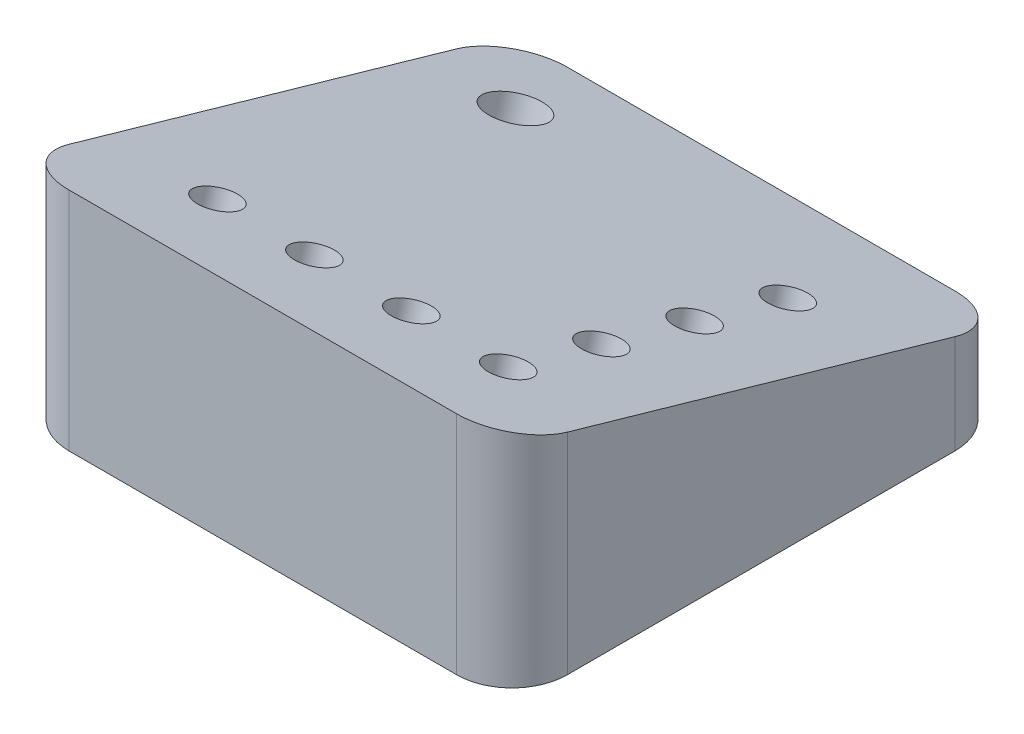
ISO-10303-21;
HEADER;
FILE_DESCRIPTION(('STEP AP214'),'2;1');
FILE_NAME('part.step','',(''),(''),'','','');
FILE_SCHEMA(('AUTOMOTIVE_DESIGN { 1 0 10303 214 1 1 1 1 }'));
ENDSEC;
DATA;
#1=APPLICATION_CONTEXT('core data for automotive mechanical design processes');
#2=APPLICATION_PROTOCOL_DEFINITION('international standard','automotive_design',2000,#1);
#3=PRODUCT_CONTEXT('',#1,'mechanical');
#4=PRODUCT('Part','Part','',(#3));
#5=PRODUCT_RELATED_PRODUCT_CATEGORY('part','',(#4));
#6=PRODUCT_DEFINITION_FORMATION('','',#4);
#7=PRODUCT_DEFINITION_CONTEXT('part definition',#1,'design');
#8=PRODUCT_DEFINITION('design','',#6,#7);
#9=PRODUCT_DEFINITION_SHAPE('','',#8);
#10=(LENGTH_UNIT() NAMED_UNIT(*) SI_UNIT(.MILLI.,.METRE.));
#11=(NAMED_UNIT(*) PLANE_ANGLE_UNIT() SI_UNIT($,.RADIAN.));
#12=(NAMED_UNIT(*) SI_UNIT($,.STERADIAN.) SOLID_ANGLE_UNIT());
#13=UNCERTAINTY_MEASURE_WITH_UNIT(LENGTH_MEASURE(1.E-05),#10,'distance_accuracy_value','');
#14=(GEOMETRIC_REPRESENTATION_CONTEXT(3) GLOBAL_UNCERTAINTY_ASSIGNED_CONTEXT((#13)) GLOBAL_UNIT_ASSIGNED_CONTEXT((#10,
#11,#12)) REPRESENTATION_CONTEXT('',''));
#15=CARTESIAN_POINT('',(0.,0.,0.));
#16=DIRECTION('',(0.,0.,1.));
#17=DIRECTION('',(1.,0.,0.));
#18=AXIS2_PLACEMENT_3D('',#15,#16,#17);
#19=CARTESIAN_POINT('',(36.,12.,-37.2354791231056));
#20=DIRECTION('',(0.,-0.961261695938321,0.275637355816993));
#21=DIRECTION('',(0.,-0.275637355816993,-0.961261695938321));
#22=AXIS2_PLACEMENT_3D('',#19,#20,#21);
#23=PLANE('',#22);
#24=CARTESIAN_POINT('',(22.,17.2099758488821,-19.0661340956516));
#25=DIRECTION('',(0.,0.961261695938321,-0.275637355816993));
#26=DIRECTION('',(0.,0.275637355816993,0.961261695938321));
#27=AXIS2_PLACEMENT_3D('',#24,#25,#26);
#28=CIRCLE('',#27,3.);
#29=CARTESIAN_POINT('',(22.,18.036887916333,-16.1823490078366));
#30=VERTEX_POINT('',#29);
#31=EDGE_CURVE('E262',#30,#30,#28,.T.);
#32=ORIENTED_EDGE('',*,*,#31,.F.);
#33=EDGE_LOOP('',(#32));
#34=FACE_BOUND('',#33,.T.);
#35=CARTESIAN_POINT('',(22.,21.06889883032,-5.60847035251506));
#36=DIRECTION('',(0.,0.961261695938321,-0.275637355816993));
#37=DIRECTION('',(0.,0.275637355816993,0.961261695938321));
#38=AXIS2_PLACEMENT_3D('',#35,#36,#37);
#39=CIRCLE('',#38,3.);
#40=CARTESIAN_POINT('',(22.,21.8958108977709,-2.7246852647001));
#41=VERTEX_POINT('',#40);
#42=EDGE_CURVE('E256',#41,#41,#39,.T.);
#43=ORIENTED_EDGE('',*,*,#42,.F.);
#44=EDGE_LOOP('',(#43));
#45=FACE_BOUND('',#44,.T.);
#46=CARTESIAN_POINT('',(22.,24.9278218117579,7.84919339062143));
#47=DIRECTION('',(0.,0.961261695938321,-0.275637355816993));
#48=DIRECTION('',(0.,0.275637355816993,0.961261695938321));
#49=AXIS2_PLACEMENT_3D('',#46,#47,#48);
#50=CIRCLE('',#49,3.);
#51=CARTESIAN_POINT('',(22.,25.7547338792088,10.7329784784364));
#52=VERTEX_POINT('',#51);
#53=EDGE_CURVE('E250',#52,#52,#50,.T.);
#54=ORIENTED_EDGE('',*,*,#53,.F.);
#55=EDGE_LOOP('',(#54));
#56=FACE_BOUND('',#55,.T.);
#57=CARTESIAN_POINT('',(22.,28.7867447931957,21.3068571337579));
#58=DIRECTION('',(0.,0.961261695938321,-0.275637355816993));
#59=DIRECTION('',(0.,0.275637355816993,0.961261695938321));
#60=AXIS2_PLACEMENT_3D('',#57,#58,#59);
#61=CIRCLE('',#60,3.);
#62=CARTESIAN_POINT('',(22.,29.6136568606467,24.1906422215729));
#63=VERTEX_POINT('',#62);
#64=EDGE_CURVE('E244',#63,#63,#61,.T.);
#65=ORIENTED_EDGE('',*,*,#64,.F.);
#66=EDGE_LOOP('',(#65));
#67=FACE_BOUND('',#66,.T.);
#68=CARTESIAN_POINT('',(8.,28.7867447931957,21.3068571337579));
#69=DIRECTION('',(0.,0.961261695938321,-0.275637355816993));
#70=DIRECTION('',(0.,0.275637355816993,0.961261695938321));
#71=AXIS2_PLACEMENT_3D('',#68,#69,#70);
#72=CIRCLE('',#71,3.);
#73=CARTESIAN_POINT('',(8.,29.6136568606467,24.1906422215729));
#74=VERTEX_POINT('',#73);
#75=EDGE_CURVE('E238',#74,#74,#72,.T.);
#76=ORIENTED_EDGE('',*,*,#75,.F.);
#77=EDGE_LOOP('',(#76));
#78=FACE_BOUND('',#77,.T.);
#79=CARTESIAN_POINT('',(-6.,28.7867447931957,21.3068571337579));
#80=DIRECTION('',(0.,0.961261695938321,-0.275637355816993));
#81=DIRECTION('',(0.,0.275637355816993,0.961261695938321));
#82=AXIS2_PLACEMENT_3D('',#79,#80,#81);
#83=CIRCLE('',#82,3.);
#84=CARTESIAN_POINT('',(-6.,29.6136568606467,24.1906422215729));
#85=VERTEX_POINT('',#84);
#86=EDGE_CURVE('E232',#85,#85,#83,.T.);
#87=ORIENTED_EDGE('',*,*,#86,.F.);
#88=EDGE_LOOP('',(#87));
#89=FACE_BOUND('',#88,.T.);
#90=CARTESIAN_POINT('',(-20.,28.7867447931957,21.3068571337579));
#91=DIRECTION('',(0.,0.961261695938321,-0.275637355816993));
#92=DIRECTION('',(0.,0.275637355816993,0.961261695938321));
#93=AXIS2_PLACEMENT_3D('',#90,#91,#92);
#94=CIRCLE('',#93,3.);
#95=CARTESIAN_POINT('',(-20.,29.6136568606467,24.1906422215729));
#96=VERTEX_POINT('',#95);
#97=EDGE_CURVE('E226',#96,#96,#94,.T.);
#98=ORIENTED_EDGE('',*,*,#97,.F.);
#99=EDGE_LOOP('',(#98));
#100=FACE_BOUND('',#99,.T.);
#101=CARTESIAN_POINT('',(-23.,15.5832856256209,-24.7390770759074));
#102=DIRECTION('',(0.,0.961261695938321,-0.275637355816993));
#103=DIRECTION('',(0.,0.275637355816993,0.961261695938321));
#104=AXIS2_PLACEMENT_3D('',#101,#102,#103);
#105=CIRCLE('',#104,4.);
#106=CARTESIAN_POINT('',(-23.,16.6858350488889,-20.8940302921541));
#107=VERTEX_POINT('',#106);
#108=EDGE_CURVE('E220',#107,#107,#105,.T.);
#109=ORIENTED_EDGE('',*,*,#108,.F.);
#110=EDGE_LOOP('',(#109));
#111=FACE_BOUND('',#110,.T.);
#112=DIRECTION('',(-1.,0.,0.));
#113=VECTOR('',#112,1.);
#114=CARTESIAN_POINT('',(36.,12.,-37.2354791231056));
#115=LINE('',#114,#113);
#116=CARTESIAN_POINT('',(28.,12.,-37.2354791231056));
#117=VERTEX_POINT('',#116);
#118=CARTESIAN_POINT('',(-28.,12.,-37.2354791231056));
#119=VERTEX_POINT('',#118);
#120=EDGE_CURVE('E102',#117,#119,#115,.T.);
#121=ORIENTED_EDGE('',*,*,#120,.T.);
#122=CARTESIAN_POINT('',(-28.,14.2939630860704,-29.2354791231056));
#123=DIRECTION('',(0.,-0.961261695938321,0.275637355816993));
#124=DIRECTION('',(0.,0.275637355816993,0.961261695938321));
#125=AXIS2_PLACEMENT_3D('',#122,#123,#124);
#126=ELLIPSE('',#125,8.3223954868928,8.);
#127=CARTESIAN_POINT('',(-36.,14.2939630860704,-29.2354791231056));
#128=VERTEX_POINT('',#127);
#129=EDGE_CURVE('E109',#119,#128,#126,.F.);
#130=ORIENTED_EDGE('',*,*,#129,.T.);
#131=DIRECTION('',(0.,0.275637355816993,0.961261695938321));
#132=VECTOR('',#131,1.);
#133=CARTESIAN_POINT('',(-36.,12.,-37.2354791231056));
#134=LINE('',#133,#132);
#135=CARTESIAN_POINT('',(-36.,30.3517046885632,26.7645208768944));
#136=VERTEX_POINT('',#135);
#137=EDGE_CURVE('E171',#128,#136,#134,.T.);
#138=ORIENTED_EDGE('',*,*,#137,.T.);
#139=CARTESIAN_POINT('',(-28.,30.3517046885632,26.7645208768944));
#140=DIRECTION('',(0.,-0.961261695938321,0.275637355816993));
#141=DIRECTION('',(0.,-0.275637355816993,-0.961261695938321));
#142=AXIS2_PLACEMENT_3D('',#139,#140,#141);
#143=ELLIPSE('',#142,8.3223954868928,8.);
#144=CARTESIAN_POINT('',(-28.,32.6456677746336,34.7645208768944));
#145=VERTEX_POINT('',#144);
#146=EDGE_CURVE('E110',#136,#145,#143,.F.);
#147=ORIENTED_EDGE('',*,*,#146,.T.);
#148=DIRECTION('',(-1.,0.,0.));
#149=VECTOR('',#148,1.);
#150=CARTESIAN_POINT('',(36.,32.6456677746336,34.7645208768944));
#151=LINE('',#150,#149);
#152=CARTESIAN_POINT('',(28.,32.6456677746336,34.7645208768944));
#153=VERTEX_POINT('',#152);
#154=EDGE_CURVE('E126',#153,#145,#151,.T.);
#155=ORIENTED_EDGE('',*,*,#154,.F.);
#156=CARTESIAN_POINT('',(28.,30.3517046885632,26.7645208768944));
#157=DIRECTION('',(0.,-0.961261695938321,0.275637355816993));
#158=DIRECTION('',(0.,0.275637355816993,0.961261695938321));
#159=AXIS2_PLACEMENT_3D('',#156,#157,#158);
#160=ELLIPSE('',#159,8.3223954868928,8.);
#161=CARTESIAN_POINT('',(36.,30.3517046885632,26.7645208768944));
#162=VERTEX_POINT('',#161);
#163=EDGE_CURVE('E128',#153,#162,#160,.F.);
#164=ORIENTED_EDGE('',*,*,#163,.T.);
#165=DIRECTION('',(0.,0.275637355816993,0.961261695938321));
#166=VECTOR('',#165,1.);
#167=CARTESIAN_POINT('',(36.,12.,-37.2354791231056));
#168=LINE('',#167,#166);
#169=CARTESIAN_POINT('',(36.,14.2939630860704,-29.2354791231056));
#170=VERTEX_POINT('',#169);
#171=EDGE_CURVE('E104',#170,#162,#168,.T.);
#172=ORIENTED_EDGE('',*,*,#171,.F.);
#173=CARTESIAN_POINT('',(28.,14.2939630860704,-29.2354791231056));
#174=DIRECTION('',(0.,-0.961261695938321,0.275637355816993));
#175=DIRECTION('',(0.,-0.275637355816993,-0.961261695938321));
#176=AXIS2_PLACEMENT_3D('',#173,#174,#175);
#177=ELLIPSE('',#176,8.3223954868928,8.);
#178=EDGE_CURVE('E100',#170,#117,#177,.F.);
#179=ORIENTED_EDGE('',*,*,#178,.T.);
#180=EDGE_LOOP('',(#121,#130,#138,#147,#155,#164,#172,#179));
#181=FACE_BOUND('',#180,.T.);
#182=ADVANCED_FACE('F33',(#34,#45,#56,#67,#78,#89,#100,#111,#181),#23,.F.);
#183=CARTESIAN_POINT('',(36.,32.6456677746336,34.7645208768944));
#184=DIRECTION('',(0.,0.,-1.));
#185=DIRECTION('',(0.,1.,0.));
#186=AXIS2_PLACEMENT_3D('',#183,#184,#185);
#187=PLANE('',#186);
#188=ORIENTED_EDGE('',*,*,#154,.T.);
#189=DIRECTION('',(0.,-1.,0.));
#190=VECTOR('',#189,1.);
#191=CARTESIAN_POINT('',(-28.,32.6456677746336,34.7645208768944));
#192=LINE('',#191,#190);
#193=CARTESIAN_POINT('',(-28.,0.,34.7645208768944));
#194=VERTEX_POINT('',#193);
#195=EDGE_CURVE('E11',#145,#194,#192,.T.);
#196=ORIENTED_EDGE('',*,*,#195,.T.);
#197=DIRECTION('',(-1.,0.,0.));
#198=VECTOR('',#197,1.);
#199=CARTESIAN_POINT('',(36.,0.,34.7645208768944));
#200=LINE('',#199,#198);
#201=CARTESIAN_POINT('',(28.,0.,34.7645208768944));
#202=VERTEX_POINT('',#201);
#203=EDGE_CURVE('E131',#202,#194,#200,.T.);
#204=ORIENTED_EDGE('',*,*,#203,.F.);
#205=DIRECTION('',(0.,-1.,0.));
#206=VECTOR('',#205,1.);
#207=CARTESIAN_POINT('',(28.,32.6456677746336,34.7645208768944));
#208=LINE('',#207,#206);
#209=EDGE_CURVE('E42',#202,#153,#208,.F.);
#210=ORIENTED_EDGE('',*,*,#209,.T.);
#211=EDGE_LOOP('',(#188,#196,#204,#210));
#212=FACE_BOUND('',#211,.T.);
#213=ADVANCED_FACE('F155',(#212),#187,.F.);
#214=CARTESIAN_POINT('',(36.,0.,34.7645208768944));
#215=DIRECTION('',(0.,1.,0.));
#216=DIRECTION('',(0.,0.,1.));
#217=AXIS2_PLACEMENT_3D('',#214,#215,#216);
#218=PLANE('',#217);
#219=CARTESIAN_POINT('',(-23.,0.,-20.2706418277992));
#220=DIRECTION('',(0.,1.,0.));
#221=DIRECTION('',(0.,0.,-1.));
#222=AXIS2_PLACEMENT_3D('',#219,#220,#221);
#223=ELLIPSE('',#222,4.1611977434464,4.);
#224=CARTESIAN_POINT('',(-23.,0.,-24.4318395712456));
#225=VERTEX_POINT('',#224);
#226=EDGE_CURVE('E37',#225,#225,#223,.T.);
#227=ORIENTED_EDGE('',*,*,#226,.T.);
#228=EDGE_LOOP('',(#227));
#229=FACE_BOUND('',#228,.T.);
#230=DIRECTION('',(0.,0.,-1.));
#231=VECTOR('',#230,1.);
#232=CARTESIAN_POINT('',(-36.,0.,34.7645208768944));
#233=LINE('',#232,#231);
#234=CARTESIAN_POINT('',(-36.,0.,26.7645208768944));
#235=VERTEX_POINT('',#234);
#236=CARTESIAN_POINT('',(-36.,0.,-29.2354791231056));
#237=VERTEX_POINT('',#236);
#238=EDGE_CURVE('E167',#235,#237,#233,.T.);
#239=ORIENTED_EDGE('',*,*,#238,.T.);
#240=CARTESIAN_POINT('',(-28.,0.,-29.2354791231056));
#241=DIRECTION('',(0.,1.,0.));
#242=DIRECTION('',(0.,0.,1.));
#243=AXIS2_PLACEMENT_3D('',#240,#241,#242);
#244=CIRCLE('',#243,8.);
#245=CARTESIAN_POINT('',(-28.,0.,-37.2354791231056));
#246=VERTEX_POINT('',#245);
#247=EDGE_CURVE('E145',#237,#246,#244,.F.);
#248=ORIENTED_EDGE('',*,*,#247,.T.);
#249=DIRECTION('',(-1.,0.,0.));
#250=VECTOR('',#249,1.);
#251=CARTESIAN_POINT('',(36.,0.,-37.2354791231056));
#252=LINE('',#251,#250);
#253=CARTESIAN_POINT('',(28.,0.,-37.2354791231056));
#254=VERTEX_POINT('',#253);
#255=EDGE_CURVE('E120',#254,#246,#252,.T.);
#256=ORIENTED_EDGE('',*,*,#255,.F.);
#257=CARTESIAN_POINT('',(28.,0.,-29.2354791231056));
#258=DIRECTION('',(0.,1.,0.));
#259=DIRECTION('',(0.,0.,1.));
#260=AXIS2_PLACEMENT_3D('',#257,#258,#259);
#261=CIRCLE('',#260,8.);
#262=CARTESIAN_POINT('',(36.,0.,-29.2354791231056));
#263=VERTEX_POINT('',#262);
#264=EDGE_CURVE('E125',#254,#263,#261,.F.);
#265=ORIENTED_EDGE('',*,*,#264,.T.);
#266=DIRECTION('',(0.,0.,-1.));
#267=VECTOR('',#266,1.);
#268=CARTESIAN_POINT('',(36.,0.,34.7645208768944));
#269=LINE('',#268,#267);
#270=CARTESIAN_POINT('',(36.,0.,26.7645208768944));
#271=VERTEX_POINT('',#270);
#272=EDGE_CURVE('E121',#271,#263,#269,.T.);
#273=ORIENTED_EDGE('',*,*,#272,.F.);
#274=CARTESIAN_POINT('',(28.,0.,26.7645208768944));
#275=DIRECTION('',(0.,1.,0.));
#276=DIRECTION('',(0.,0.,1.));
#277=AXIS2_PLACEMENT_3D('',#274,#275,#276);
#278=CIRCLE('',#277,8.);
#279=EDGE_CURVE('E56',#271,#202,#278,.F.);
#280=ORIENTED_EDGE('',*,*,#279,.T.);
#281=ORIENTED_EDGE('',*,*,#203,.T.);
#282=CARTESIAN_POINT('',(-28.,0.,26.7645208768944));
#283=DIRECTION('',(0.,1.,0.));
#284=DIRECTION('',(0.,0.,1.));
#285=AXIS2_PLACEMENT_3D('',#282,#283,#284);
#286=CIRCLE('',#285,8.);
#287=EDGE_CURVE('E49',#194,#235,#286,.F.);
#288=ORIENTED_EDGE('',*,*,#287,.T.);
#289=EDGE_LOOP('',(#239,#248,#256,#265,#273,#280,#281,#288));
#290=FACE_BOUND('',#289,.T.);
#291=ADVANCED_FACE('F165',(#229,#290),#218,.F.);
#292=CARTESIAN_POINT('',(36.,0.,-37.2354791231056));
#293=DIRECTION('',(0.,0.,1.));
#294=DIRECTION('',(1.,0.,0.));
#295=AXIS2_PLACEMENT_3D('',#292,#293,#294);
#296=PLANE('',#295);
#297=ORIENTED_EDGE('',*,*,#255,.T.);
#298=DIRECTION('',(0.,1.,0.));
#299=VECTOR('',#298,1.);
#300=CARTESIAN_POINT('',(-28.,0.,-37.2354791231056));
#301=LINE('',#300,#299);
#302=EDGE_CURVE('E119',#246,#119,#301,.T.);
#303=ORIENTED_EDGE('',*,*,#302,.T.);
#304=ORIENTED_EDGE('',*,*,#120,.F.);
#305=DIRECTION('',(0.,1.,0.));
#306=VECTOR('',#305,1.);
#307=CARTESIAN_POINT('',(28.,0.,-37.2354791231056));
#308=LINE('',#307,#306);
#309=EDGE_CURVE('E116',#117,#254,#308,.F.);
#310=ORIENTED_EDGE('',*,*,#309,.T.);
#311=EDGE_LOOP('',(#297,#303,#304,#310));
#312=FACE_BOUND('',#311,.T.);
#313=ADVANCED_FACE('F115',(#312),#296,.F.);
#314=CARTESIAN_POINT('',(36.,0.,0.));
#315=DIRECTION('',(1.,0.,0.));
#316=DIRECTION('',(0.,0.,-1.));
#317=AXIS2_PLACEMENT_3D('',#314,#315,#316);
#318=PLANE('',#317);
#319=ORIENTED_EDGE('',*,*,#272,.T.);
#320=DIRECTION('',(0.,1.,0.));
#321=VECTOR('',#320,1.);
#322=CARTESIAN_POINT('',(36.,12.,-29.2354791231056));
#323=LINE('',#322,#321);
#324=EDGE_CURVE('E150',#263,#170,#323,.T.);
#325=ORIENTED_EDGE('',*,*,#324,.T.);
#326=ORIENTED_EDGE('',*,*,#171,.T.);
#327=DIRECTION('',(0.,-1.,0.));
#328=VECTOR('',#327,1.);
#329=CARTESIAN_POINT('',(36.,0.,26.7645208768944));
#330=LINE('',#329,#328);
#331=EDGE_CURVE('E147',#162,#271,#330,.T.);
#332=ORIENTED_EDGE('',*,*,#331,.T.);
#333=EDGE_LOOP('',(#319,#325,#326,#332));
#334=FACE_BOUND('',#333,.T.);
#335=ADVANCED_FACE('F163',(#334),#318,.T.);
#336=CARTESIAN_POINT('',(-36.,0.,0.));
#337=DIRECTION('',(1.,0.,0.));
#338=DIRECTION('',(0.,0.,-1.));
#339=AXIS2_PLACEMENT_3D('',#336,#337,#338);
#340=PLANE('',#339);
#341=ORIENTED_EDGE('',*,*,#137,.F.);
#342=DIRECTION('',(0.,1.,0.));
#343=VECTOR('',#342,1.);
#344=CARTESIAN_POINT('',(-36.,0.,-29.2354791231056));
#345=LINE('',#344,#343);
#346=EDGE_CURVE('E140',#128,#237,#345,.F.);
#347=ORIENTED_EDGE('',*,*,#346,.T.);
#348=ORIENTED_EDGE('',*,*,#238,.F.);
#349=DIRECTION('',(0.,-1.,0.));
#350=VECTOR('',#349,1.);
#351=CARTESIAN_POINT('',(-36.,0.,26.7645208768944));
#352=LINE('',#351,#350);
#353=EDGE_CURVE('E138',#235,#136,#352,.F.);
#354=ORIENTED_EDGE('',*,*,#353,.T.);
#355=EDGE_LOOP('',(#341,#347,#348,#354));
#356=FACE_BOUND('',#355,.T.);
#357=ADVANCED_FACE('F178',(#356),#340,.F.);
#358=CARTESIAN_POINT('',(-28.,0.,-29.2354791231056));
#359=DIRECTION('',(0.,1.,0.));
#360=DIRECTION('',(0.,0.,1.));
#361=AXIS2_PLACEMENT_3D('',#358,#359,#360);
#362=CYLINDRICAL_SURFACE('',#361,8.);
#363=ORIENTED_EDGE('',*,*,#247,.F.);
#364=ORIENTED_EDGE('',*,*,#346,.F.);
#365=ORIENTED_EDGE('',*,*,#129,.F.);
#366=ORIENTED_EDGE('',*,*,#302,.F.);
#367=EDGE_LOOP('',(#363,#364,#365,#366));
#368=FACE_BOUND('',#367,.T.);
#369=ADVANCED_FACE('F187',(#368),#362,.T.);
#370=CARTESIAN_POINT('',(28.,0.,-29.2354791231056));
#371=DIRECTION('',(0.,-1.,0.));
#372=DIRECTION('',(0.,0.,-1.));
#373=AXIS2_PLACEMENT_3D('',#370,#371,#372);
#374=CYLINDRICAL_SURFACE('',#373,8.);
#375=ORIENTED_EDGE('',*,*,#264,.F.);
#376=ORIENTED_EDGE('',*,*,#309,.F.);
#377=ORIENTED_EDGE('',*,*,#178,.F.);
#378=ORIENTED_EDGE('',*,*,#324,.F.);
#379=EDGE_LOOP('',(#375,#376,#377,#378));
#380=FACE_BOUND('',#379,.T.);
#381=ADVANCED_FACE('F124',(#380),#374,.T.);
#382=CARTESIAN_POINT('',(-28.,32.6456677746336,26.7645208768944));
#383=DIRECTION('',(0.,-1.,0.));
#384=DIRECTION('',(0.,0.,-1.));
#385=AXIS2_PLACEMENT_3D('',#382,#383,#384);
#386=CYLINDRICAL_SURFACE('',#385,8.);
#387=ORIENTED_EDGE('',*,*,#146,.F.);
#388=ORIENTED_EDGE('',*,*,#353,.F.);
#389=ORIENTED_EDGE('',*,*,#287,.F.);
#390=ORIENTED_EDGE('',*,*,#195,.F.);
#391=EDGE_LOOP('',(#387,#388,#389,#390));
#392=FACE_BOUND('',#391,.T.);
#393=ADVANCED_FACE('F180',(#392),#386,.T.);
#394=CARTESIAN_POINT('',(28.,0.,26.7645208768944));
#395=DIRECTION('',(0.,1.,0.));
#396=DIRECTION('',(0.,0.,1.));
#397=AXIS2_PLACEMENT_3D('',#394,#395,#396);
#398=CYLINDRICAL_SURFACE('',#397,8.);
#399=ORIENTED_EDGE('',*,*,#163,.F.);
#400=ORIENTED_EDGE('',*,*,#209,.F.);
#401=ORIENTED_EDGE('',*,*,#279,.F.);
#402=ORIENTED_EDGE('',*,*,#331,.F.);
#403=EDGE_LOOP('',(#399,#400,#401,#402));
#404=FACE_BOUND('',#403,.T.);
#405=ADVANCED_FACE('F35',(#404),#398,.T.);
#406=CARTESIAN_POINT('',(-23.,-14.5820964637127,-16.0892929521399));
#407=DIRECTION('',(0.,0.961261695938321,-0.275637355816993));
#408=DIRECTION('',(0.,0.275637355816993,0.961261695938321));
#409=AXIS2_PLACEMENT_3D('',#406,#407,#408);
#410=CYLINDRICAL_SURFACE('',#409,4.);
#411=ORIENTED_EDGE('',*,*,#108,.T.);
#412=EDGE_LOOP('',(#411));
#413=FACE_BOUND('',#412,.T.);
#414=ORIENTED_EDGE('',*,*,#226,.F.);
#415=EDGE_LOOP('',(#414));
#416=FACE_BOUND('',#415,.T.);
#417=ADVANCED_FACE('F186',(#413,#416),#410,.F.);
#418=CARTESIAN_POINT('',(-20.,17.2516044419359,24.6145054035618));
#419=DIRECTION('',(0.,0.961261695938321,-0.275637355816993));
#420=DIRECTION('',(0.,0.275637355816993,0.961261695938321));
#421=AXIS2_PLACEMENT_3D('',#418,#419,#420);
#422=CYLINDRICAL_SURFACE('',#421,3.);
#423=CARTESIAN_POINT('',(-20.,17.2516044419359,24.6145054035618));
#424=DIRECTION('',(0.,0.961261695938321,-0.275637355816993));
#425=DIRECTION('',(0.,0.275637355816993,0.961261695938321));
#426=AXIS2_PLACEMENT_3D('',#423,#424,#425);
#427=CIRCLE('',#426,3.);
#428=CARTESIAN_POINT('',(-20.,18.0785165093869,27.4982904913768));
#429=VERTEX_POINT('',#428);
#430=EDGE_CURVE('E222',#429,#429,#427,.T.);
#431=ORIENTED_EDGE('',*,*,#430,.F.);
#432=EDGE_LOOP('',(#431));
#433=FACE_BOUND('',#432,.T.);
#434=ORIENTED_EDGE('',*,*,#97,.T.);
#435=EDGE_LOOP('',(#434));
#436=FACE_BOUND('',#435,.T.);
#437=ADVANCED_FACE('F322',(#433,#436),#422,.F.);
#438=CARTESIAN_POINT('',(-20.,17.2516044419359,24.6145054035618));
#439=DIRECTION('',(0.,0.961261695938321,-0.275637355816993));
#440=DIRECTION('',(0.,0.275637355816993,0.961261695938321));
#441=AXIS2_PLACEMENT_3D('',#438,#439,#440);
#442=PLANE('',#441);
#443=ORIENTED_EDGE('',*,*,#430,.T.);
#444=EDGE_LOOP('',(#443));
#445=FACE_BOUND('',#444,.T.);
#446=ADVANCED_FACE('F318',(#445),#442,.T.);
#447=CARTESIAN_POINT('',(-6.,17.2516044419359,24.6145054035618));
#448=DIRECTION('',(0.,0.961261695938321,-0.275637355816993));
#449=DIRECTION('',(0.,0.275637355816993,0.961261695938321));
#450=AXIS2_PLACEMENT_3D('',#447,#448,#449);
#451=CYLINDRICAL_SURFACE('',#450,3.);
#452=CARTESIAN_POINT('',(-6.,17.2516044419359,24.6145054035618));
#453=DIRECTION('',(0.,0.961261695938321,-0.275637355816993));
#454=DIRECTION('',(0.,0.275637355816993,0.961261695938321));
#455=AXIS2_PLACEMENT_3D('',#452,#453,#454);
#456=CIRCLE('',#455,3.);
#457=CARTESIAN_POINT('',(-6.,18.0785165093869,27.4982904913768));
#458=VERTEX_POINT('',#457);
#459=EDGE_CURVE('E230',#458,#458,#456,.T.);
#460=ORIENTED_EDGE('',*,*,#459,.F.);
#461=EDGE_LOOP('',(#460));
#462=FACE_BOUND('',#461,.T.);
#463=ORIENTED_EDGE('',*,*,#86,.T.);
#464=EDGE_LOOP('',(#463));
#465=FACE_BOUND('',#464,.T.);
#466=ADVANCED_FACE('F314',(#462,#465),#451,.F.);
#467=CARTESIAN_POINT('',(-6.,17.2516044419359,24.6145054035618));
#468=DIRECTION('',(0.,0.961261695938321,-0.275637355816993));
#469=DIRECTION('',(0.,0.275637355816993,0.961261695938321));
#470=AXIS2_PLACEMENT_3D('',#467,#468,#469);
#471=PLANE('',#470);
#472=ORIENTED_EDGE('',*,*,#459,.T.);
#473=EDGE_LOOP('',(#472));
#474=FACE_BOUND('',#473,.T.);
#475=ADVANCED_FACE('F310',(#474),#471,.T.);
#476=CARTESIAN_POINT('',(8.,17.2516044419359,24.6145054035618));
#477=DIRECTION('',(0.,0.961261695938321,-0.275637355816993));
#478=DIRECTION('',(0.,0.275637355816993,0.961261695938321));
#479=AXIS2_PLACEMENT_3D('',#476,#477,#478);
#480=CYLINDRICAL_SURFACE('',#479,3.);
#481=CARTESIAN_POINT('',(8.,17.2516044419359,24.6145054035618));
#482=DIRECTION('',(0.,0.961261695938321,-0.275637355816993));
#483=DIRECTION('',(0.,0.275637355816993,0.961261695938321));
#484=AXIS2_PLACEMENT_3D('',#481,#482,#483);
#485=CIRCLE('',#484,3.);
#486=CARTESIAN_POINT('',(8.,18.0785165093869,27.4982904913768));
#487=VERTEX_POINT('',#486);
#488=EDGE_CURVE('E235',#487,#487,#485,.T.);
#489=ORIENTED_EDGE('',*,*,#488,.F.);
#490=EDGE_LOOP('',(#489));
#491=FACE_BOUND('',#490,.T.);
#492=ORIENTED_EDGE('',*,*,#75,.T.);
#493=EDGE_LOOP('',(#492));
#494=FACE_BOUND('',#493,.T.);
#495=ADVANCED_FACE('F306',(#491,#494),#480,.F.);
#496=CARTESIAN_POINT('',(8.,17.2516044419359,24.6145054035618));
#497=DIRECTION('',(0.,0.961261695938321,-0.275637355816993));
#498=DIRECTION('',(0.,0.275637355816993,0.961261695938321));
#499=AXIS2_PLACEMENT_3D('',#496,#497,#498);
#500=PLANE('',#499);
#501=ORIENTED_EDGE('',*,*,#488,.T.);
#502=EDGE_LOOP('',(#501));
#503=FACE_BOUND('',#502,.T.);
#504=ADVANCED_FACE('F302',(#503),#500,.T.);
#505=CARTESIAN_POINT('',(22.,17.2516044419359,24.6145054035618));
#506=DIRECTION('',(0.,0.961261695938321,-0.275637355816993));
#507=DIRECTION('',(0.,0.275637355816993,0.961261695938321));
#508=AXIS2_PLACEMENT_3D('',#505,#506,#507);
#509=CYLINDRICAL_SURFACE('',#508,3.);
#510=CARTESIAN_POINT('',(22.,17.2516044419359,24.6145054035618));
#511=DIRECTION('',(0.,0.961261695938321,-0.275637355816993));
#512=DIRECTION('',(0.,0.275637355816993,0.961261695938321));
#513=AXIS2_PLACEMENT_3D('',#510,#511,#512);
#514=CIRCLE('',#513,3.);
#515=CARTESIAN_POINT('',(22.,18.0785165093869,27.4982904913768));
#516=VERTEX_POINT('',#515);
#517=EDGE_CURVE('E241',#516,#516,#514,.T.);
#518=ORIENTED_EDGE('',*,*,#517,.F.);
#519=EDGE_LOOP('',(#518));
#520=FACE_BOUND('',#519,.T.);
#521=ORIENTED_EDGE('',*,*,#64,.T.);
#522=EDGE_LOOP('',(#521));
#523=FACE_BOUND('',#522,.T.);
#524=ADVANCED_FACE('F298',(#520,#523),#509,.F.);
#525=CARTESIAN_POINT('',(22.,17.2516044419359,24.6145054035618));
#526=DIRECTION('',(0.,0.961261695938321,-0.275637355816993));
#527=DIRECTION('',(0.,0.275637355816993,0.961261695938321));
#528=AXIS2_PLACEMENT_3D('',#525,#526,#527);
#529=PLANE('',#528);
#530=ORIENTED_EDGE('',*,*,#517,.T.);
#531=EDGE_LOOP('',(#530));
#532=FACE_BOUND('',#531,.T.);
#533=ADVANCED_FACE('F294',(#532),#529,.T.);
#534=CARTESIAN_POINT('',(22.,13.392681460498,11.1568416604253));
#535=DIRECTION('',(0.,0.961261695938321,-0.275637355816993));
#536=DIRECTION('',(0.,0.275637355816993,0.961261695938321));
#537=AXIS2_PLACEMENT_3D('',#534,#535,#536);
#538=CYLINDRICAL_SURFACE('',#537,3.);
#539=CARTESIAN_POINT('',(22.,13.392681460498,11.1568416604253));
#540=DIRECTION('',(0.,0.961261695938321,-0.275637355816993));
#541=DIRECTION('',(0.,0.275637355816993,0.961261695938321));
#542=AXIS2_PLACEMENT_3D('',#539,#540,#541);
#543=CIRCLE('',#542,3.);
#544=CARTESIAN_POINT('',(22.,14.219593527949,14.0406267482403));
#545=VERTEX_POINT('',#544);
#546=EDGE_CURVE('E247',#545,#545,#543,.T.);
#547=ORIENTED_EDGE('',*,*,#546,.F.);
#548=EDGE_LOOP('',(#547));
#549=FACE_BOUND('',#548,.T.);
#550=ORIENTED_EDGE('',*,*,#53,.T.);
#551=EDGE_LOOP('',(#550));
#552=FACE_BOUND('',#551,.T.);
#553=ADVANCED_FACE('F290',(#549,#552),#538,.F.);
#554=CARTESIAN_POINT('',(22.,13.392681460498,11.1568416604253));
#555=DIRECTION('',(0.,0.961261695938321,-0.275637355816993));
#556=DIRECTION('',(0.,0.275637355816993,0.961261695938321));
#557=AXIS2_PLACEMENT_3D('',#554,#555,#556);
#558=PLANE('',#557);
#559=ORIENTED_EDGE('',*,*,#546,.T.);
#560=EDGE_LOOP('',(#559));
#561=FACE_BOUND('',#560,.T.);
#562=ADVANCED_FACE('F286',(#561),#558,.T.);
#563=CARTESIAN_POINT('',(22.,9.53375847906011,-2.30082208271115));
#564=DIRECTION('',(0.,0.961261695938321,-0.275637355816993));
#565=DIRECTION('',(0.,0.275637355816993,0.961261695938321));
#566=AXIS2_PLACEMENT_3D('',#563,#564,#565);
#567=CYLINDRICAL_SURFACE('',#566,3.);
#568=CARTESIAN_POINT('',(22.,9.53375847906011,-2.30082208271115));
#569=DIRECTION('',(0.,0.961261695938321,-0.275637355816993));
#570=DIRECTION('',(0.,0.275637355816993,0.961261695938321));
#571=AXIS2_PLACEMENT_3D('',#568,#569,#570);
#572=CIRCLE('',#571,3.);
#573=CARTESIAN_POINT('',(22.,10.3606705465111,0.582963005103812));
#574=VERTEX_POINT('',#573);
#575=EDGE_CURVE('E253',#574,#574,#572,.T.);
#576=ORIENTED_EDGE('',*,*,#575,.F.);
#577=EDGE_LOOP('',(#576));
#578=FACE_BOUND('',#577,.T.);
#579=ORIENTED_EDGE('',*,*,#42,.T.);
#580=EDGE_LOOP('',(#579));
#581=FACE_BOUND('',#580,.T.);
#582=ADVANCED_FACE('F280',(#578,#581),#567,.F.);
#583=CARTESIAN_POINT('',(22.,9.53375847906011,-2.30082208271115));
#584=DIRECTION('',(0.,0.961261695938321,-0.275637355816993));
#585=DIRECTION('',(0.,0.275637355816993,0.961261695938321));
#586=AXIS2_PLACEMENT_3D('',#583,#584,#585);
#587=PLANE('',#586);
#588=ORIENTED_EDGE('',*,*,#575,.T.);
#589=EDGE_LOOP('',(#588));
#590=FACE_BOUND('',#589,.T.);
#591=ADVANCED_FACE('F273',(#590),#587,.T.);
#592=CARTESIAN_POINT('',(22.,5.67483549762221,-15.7584858258476));
#593=DIRECTION('',(0.,0.961261695938321,-0.275637355816993));
#594=DIRECTION('',(0.,0.275637355816993,0.961261695938321));
#595=AXIS2_PLACEMENT_3D('',#592,#593,#594);
#596=CYLINDRICAL_SURFACE('',#595,3.);
#597=CARTESIAN_POINT('',(22.,5.67483549762221,-15.7584858258476));
#598=DIRECTION('',(0.,0.961261695938321,-0.275637355816993));
#599=DIRECTION('',(0.,0.275637355816993,0.961261695938321));
#600=AXIS2_PLACEMENT_3D('',#597,#598,#599);
#601=CIRCLE('',#600,3.);
#602=CARTESIAN_POINT('',(22.,6.50174756507319,-12.8747007380327));
#603=VERTEX_POINT('',#602);
#604=EDGE_CURVE('E259',#603,#603,#601,.T.);
#605=ORIENTED_EDGE('',*,*,#604,.F.);
#606=EDGE_LOOP('',(#605));
#607=FACE_BOUND('',#606,.T.);
#608=ORIENTED_EDGE('',*,*,#31,.T.);
#609=EDGE_LOOP('',(#608));
#610=FACE_BOUND('',#609,.T.);
#611=ADVANCED_FACE('F270',(#607,#610),#596,.F.);
#612=CARTESIAN_POINT('',(22.,5.67483549762221,-15.7584858258476));
#613=DIRECTION('',(0.,0.961261695938321,-0.275637355816993));
#614=DIRECTION('',(0.,0.275637355816993,0.961261695938321));
#615=AXIS2_PLACEMENT_3D('',#612,#613,#614);
#616=PLANE('',#615);
#617=ORIENTED_EDGE('',*,*,#604,.T.);
#618=EDGE_LOOP('',(#617));
#619=FACE_BOUND('',#618,.T.);
#620=ADVANCED_FACE('F268',(#619),#616,.T.);
#621=CLOSED_SHELL('',(#182,#213,#291,#313,#335,#357,#369,#381,#393,#405,#417,#437,#446,#466,
#475,#495,#504,#524,#533,#553,#562,#582,#591,#611,#620));
#622=MANIFOLD_SOLID_BREP('B2',#621);
#623=ADVANCED_BREP_SHAPE_REPRESENTATION('',(#18,#622),#14);
#624=SHAPE_DEFINITION_REPRESENTATION(#9,#623);
ENDSEC;
END-ISO-10303-21;
